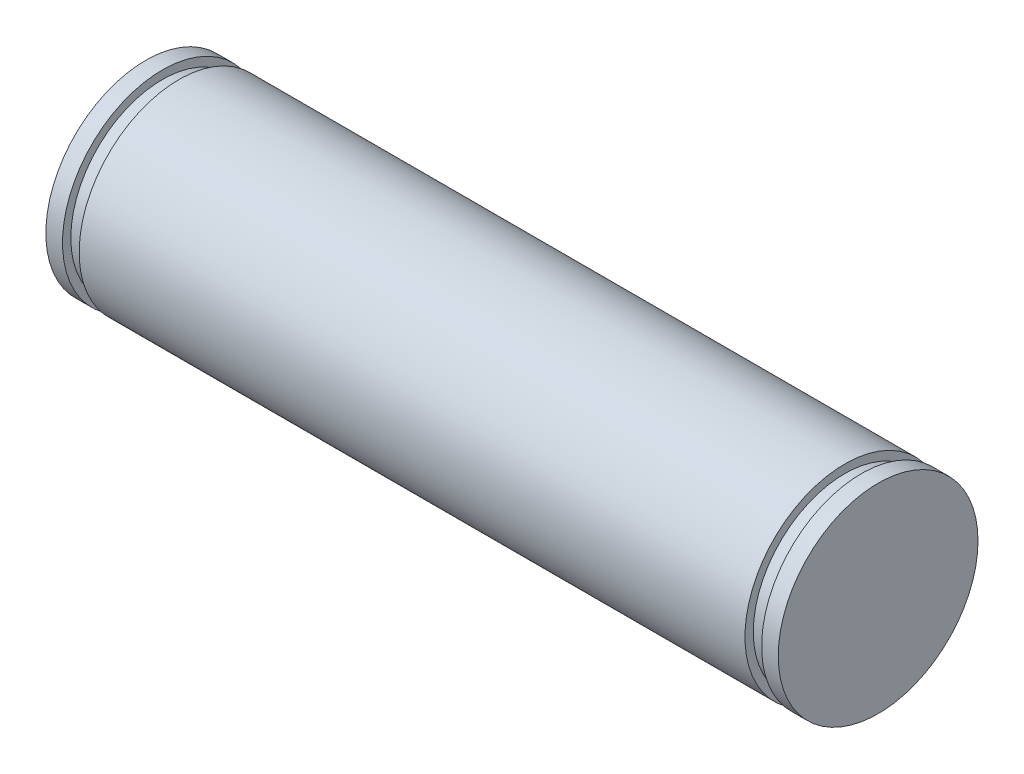
ISO-10303-21;
HEADER;
FILE_DESCRIPTION(('STEP AP214'),'2;1');
FILE_NAME('part.step','',(''),(''),'','','');
FILE_SCHEMA(('AUTOMOTIVE_DESIGN { 1 0 10303 214 1 1 1 1 }'));
ENDSEC;
DATA;
#1=APPLICATION_CONTEXT('core data for automotive mechanical design processes');
#2=APPLICATION_PROTOCOL_DEFINITION('international standard','automotive_design',2000,#1);
#3=PRODUCT_CONTEXT('',#1,'mechanical');
#4=PRODUCT('Part','Part','',(#3));
#5=PRODUCT_RELATED_PRODUCT_CATEGORY('part','',(#4));
#6=PRODUCT_DEFINITION_FORMATION('','',#4);
#7=PRODUCT_DEFINITION_CONTEXT('part definition',#1,'design');
#8=PRODUCT_DEFINITION('design','',#6,#7);
#9=PRODUCT_DEFINITION_SHAPE('','',#8);
#10=(LENGTH_UNIT() NAMED_UNIT(*) SI_UNIT(.MILLI.,.METRE.));
#11=(NAMED_UNIT(*) PLANE_ANGLE_UNIT() SI_UNIT($,.RADIAN.));
#12=(NAMED_UNIT(*) SI_UNIT($,.STERADIAN.) SOLID_ANGLE_UNIT());
#13=UNCERTAINTY_MEASURE_WITH_UNIT(LENGTH_MEASURE(1.E-05),#10,'distance_accuracy_value','');
#14=(GEOMETRIC_REPRESENTATION_CONTEXT(3) GLOBAL_UNCERTAINTY_ASSIGNED_CONTEXT((#13)) GLOBAL_UNIT_ASSIGNED_CONTEXT((#10,
#11,#12)) REPRESENTATION_CONTEXT('',''));
#15=CARTESIAN_POINT('',(0.,0.,0.));
#16=DIRECTION('',(0.,0.,1.));
#17=DIRECTION('',(1.,0.,0.));
#18=AXIS2_PLACEMENT_3D('',#15,#16,#17);
#19=CARTESIAN_POINT('',(0.,0.,0.));
#20=DIRECTION('',(1.,0.,0.));
#21=DIRECTION('',(0.,0.,-1.));
#22=AXIS2_PLACEMENT_3D('',#19,#20,#21);
#23=CYLINDRICAL_SURFACE('',#22,9.525);
#24=CARTESIAN_POINT('',(3.175,0.,0.));
#25=DIRECTION('',(1.,0.,0.));
#26=DIRECTION('',(0.,0.,-1.));
#27=AXIS2_PLACEMENT_3D('',#24,#25,#26);
#28=CIRCLE('',#27,9.525);
#29=CARTESIAN_POINT('',(3.175,0.,-9.525));
#30=VERTEX_POINT('',#29);
#31=EDGE_CURVE('E31',#30,#30,#28,.F.);
#32=ORIENTED_EDGE('',*,*,#31,.F.);
#33=EDGE_LOOP('',(#32));
#34=FACE_BOUND('',#33,.T.);
#35=CARTESIAN_POINT('',(66.675,0.,0.));
#36=DIRECTION('',(1.,0.,0.));
#37=DIRECTION('',(0.,0.,-1.));
#38=AXIS2_PLACEMENT_3D('',#35,#36,#37);
#39=CIRCLE('',#38,9.525);
#40=CARTESIAN_POINT('',(66.675,0.,-9.525));
#41=VERTEX_POINT('',#40);
#42=EDGE_CURVE('E18',#41,#41,#39,.F.);
#43=ORIENTED_EDGE('',*,*,#42,.T.);
#44=EDGE_LOOP('',(#43));
#45=FACE_BOUND('',#44,.T.);
#46=ADVANCED_FACE('F14',(#34,#45),#23,.T.);
#47=CARTESIAN_POINT('',(0.,0.,0.));
#48=DIRECTION('',(1.,0.,0.));
#49=DIRECTION('',(0.,0.,-1.));
#50=AXIS2_PLACEMENT_3D('',#47,#48,#49);
#51=CIRCLE('',#50,9.525);
#52=CARTESIAN_POINT('',(0.,0.,-9.525));
#53=VERTEX_POINT('',#52);
#54=EDGE_CURVE('E22',#53,#53,#51,.T.);
#55=ORIENTED_EDGE('',*,*,#54,.T.);
#56=EDGE_LOOP('',(#55));
#57=FACE_BOUND('',#56,.T.);
#58=CARTESIAN_POINT('',(1.5875,0.,0.));
#59=DIRECTION('',(1.,0.,0.));
#60=DIRECTION('',(0.,0.,-1.));
#61=AXIS2_PLACEMENT_3D('',#58,#59,#60);
#62=CIRCLE('',#61,9.525);
#63=CARTESIAN_POINT('',(1.5875,0.,-9.525));
#64=VERTEX_POINT('',#63);
#65=EDGE_CURVE('E27',#64,#64,#62,.F.);
#66=ORIENTED_EDGE('',*,*,#65,.T.);
#67=EDGE_LOOP('',(#66));
#68=FACE_BOUND('',#67,.T.);
#69=ADVANCED_FACE('F75',(#57,#68),#23,.T.);
#70=CARTESIAN_POINT('',(0.,0.,0.));
#71=DIRECTION('',(-1.,0.,0.));
#72=DIRECTION('',(0.,0.,1.));
#73=AXIS2_PLACEMENT_3D('',#70,#71,#72);
#74=PLANE('',#73);
#75=ORIENTED_EDGE('',*,*,#54,.F.);
#76=EDGE_LOOP('',(#75));
#77=FACE_BOUND('',#76,.T.);
#78=ADVANCED_FACE('F70',(#77),#74,.T.);
#79=CARTESIAN_POINT('',(2.38125,0.,0.));
#80=DIRECTION('',(1.,0.,0.));
#81=DIRECTION('',(0.,0.,-1.));
#82=AXIS2_PLACEMENT_3D('',#79,#80,#81);
#83=CYLINDRICAL_SURFACE('',#82,8.73125);
#84=CARTESIAN_POINT('',(3.175,0.,0.));
#85=DIRECTION('',(1.,0.,0.));
#86=DIRECTION('',(0.,0.,-1.));
#87=AXIS2_PLACEMENT_3D('',#84,#85,#86);
#88=CIRCLE('',#87,8.73125);
#89=CARTESIAN_POINT('',(3.175,0.,-8.73125));
#90=VERTEX_POINT('',#89);
#91=EDGE_CURVE('E34',#90,#90,#88,.T.);
#92=ORIENTED_EDGE('',*,*,#91,.F.);
#93=EDGE_LOOP('',(#92));
#94=FACE_BOUND('',#93,.T.);
#95=CARTESIAN_POINT('',(1.5875,0.,0.));
#96=DIRECTION('',(1.,0.,0.));
#97=DIRECTION('',(0.,0.,-1.));
#98=AXIS2_PLACEMENT_3D('',#95,#96,#97);
#99=CIRCLE('',#98,8.73125);
#100=CARTESIAN_POINT('',(1.5875,0.,-8.73125));
#101=VERTEX_POINT('',#100);
#102=EDGE_CURVE('E42',#101,#101,#99,.T.);
#103=ORIENTED_EDGE('',*,*,#102,.T.);
#104=EDGE_LOOP('',(#103));
#105=FACE_BOUND('',#104,.T.);
#106=ADVANCED_FACE('F55',(#94,#105),#83,.T.);
#107=CARTESIAN_POINT('',(1.5875,0.,0.));
#108=DIRECTION('',(1.,0.,0.));
#109=DIRECTION('',(0.,0.,-1.));
#110=AXIS2_PLACEMENT_3D('',#107,#108,#109);
#111=PLANE('',#110);
#112=ORIENTED_EDGE('',*,*,#65,.F.);
#113=EDGE_LOOP('',(#112));
#114=FACE_BOUND('',#113,.T.);
#115=ORIENTED_EDGE('',*,*,#102,.F.);
#116=EDGE_LOOP('',(#115));
#117=FACE_BOUND('',#116,.T.);
#118=ADVANCED_FACE('F57',(#114,#117),#111,.T.);
#119=CARTESIAN_POINT('',(3.175,0.,0.));
#120=DIRECTION('',(1.,0.,0.));
#121=DIRECTION('',(0.,0.,-1.));
#122=AXIS2_PLACEMENT_3D('',#119,#120,#121);
#123=PLANE('',#122);
#124=ORIENTED_EDGE('',*,*,#31,.T.);
#125=EDGE_LOOP('',(#124));
#126=FACE_BOUND('',#125,.T.);
#127=ORIENTED_EDGE('',*,*,#91,.T.);
#128=EDGE_LOOP('',(#127));
#129=FACE_BOUND('',#128,.T.);
#130=ADVANCED_FACE('F59',(#126,#129),#123,.F.);
#131=CARTESIAN_POINT('',(67.46875,0.,0.));
#132=DIRECTION('',(1.,0.,0.));
#133=DIRECTION('',(0.,0.,-1.));
#134=AXIS2_PLACEMENT_3D('',#131,#132,#133);
#135=CYLINDRICAL_SURFACE('',#134,8.73125);
#136=CARTESIAN_POINT('',(68.2625,0.,0.));
#137=DIRECTION('',(1.,0.,0.));
#138=DIRECTION('',(0.,0.,-1.));
#139=AXIS2_PLACEMENT_3D('',#136,#137,#138);
#140=CIRCLE('',#139,8.73125);
#141=CARTESIAN_POINT('',(68.2625,0.,-8.73125));
#142=VERTEX_POINT('',#141);
#143=EDGE_CURVE('E38',#142,#142,#140,.T.);
#144=ORIENTED_EDGE('',*,*,#143,.F.);
#145=EDGE_LOOP('',(#144));
#146=FACE_BOUND('',#145,.T.);
#147=CARTESIAN_POINT('',(66.675,0.,0.));
#148=DIRECTION('',(1.,0.,0.));
#149=DIRECTION('',(0.,0.,-1.));
#150=AXIS2_PLACEMENT_3D('',#147,#148,#149);
#151=CIRCLE('',#150,8.73125);
#152=CARTESIAN_POINT('',(66.675,0.,-8.73125));
#153=VERTEX_POINT('',#152);
#154=EDGE_CURVE('E44',#153,#153,#151,.T.);
#155=ORIENTED_EDGE('',*,*,#154,.T.);
#156=EDGE_LOOP('',(#155));
#157=FACE_BOUND('',#156,.T.);
#158=ADVANCED_FACE('F67',(#146,#157),#135,.T.);
#159=CARTESIAN_POINT('',(66.675,0.,0.));
#160=DIRECTION('',(1.,0.,0.));
#161=DIRECTION('',(0.,0.,-1.));
#162=AXIS2_PLACEMENT_3D('',#159,#160,#161);
#163=PLANE('',#162);
#164=ORIENTED_EDGE('',*,*,#42,.F.);
#165=EDGE_LOOP('',(#164));
#166=FACE_BOUND('',#165,.T.);
#167=ORIENTED_EDGE('',*,*,#154,.F.);
#168=EDGE_LOOP('',(#167));
#169=FACE_BOUND('',#168,.T.);
#170=ADVANCED_FACE('F94',(#166,#169),#163,.T.);
#171=CARTESIAN_POINT('',(68.2625,0.,0.));
#172=DIRECTION('',(1.,0.,0.));
#173=DIRECTION('',(0.,0.,-1.));
#174=AXIS2_PLACEMENT_3D('',#171,#172,#173);
#175=PLANE('',#174);
#176=CARTESIAN_POINT('',(68.2625,0.,0.));
#177=DIRECTION('',(1.,0.,0.));
#178=DIRECTION('',(0.,0.,-1.));
#179=AXIS2_PLACEMENT_3D('',#176,#177,#178);
#180=CIRCLE('',#179,9.525);
#181=CARTESIAN_POINT('',(68.2625,0.,-9.525));
#182=VERTEX_POINT('',#181);
#183=EDGE_CURVE('E36',#182,#182,#180,.F.);
#184=ORIENTED_EDGE('',*,*,#183,.T.);
#185=EDGE_LOOP('',(#184));
#186=FACE_BOUND('',#185,.T.);
#187=ORIENTED_EDGE('',*,*,#143,.T.);
#188=EDGE_LOOP('',(#187));
#189=FACE_BOUND('',#188,.T.);
#190=ADVANCED_FACE('F89',(#186,#189),#175,.F.);
#191=CARTESIAN_POINT('',(69.85,0.,0.));
#192=DIRECTION('',(1.,0.,0.));
#193=DIRECTION('',(0.,0.,-1.));
#194=AXIS2_PLACEMENT_3D('',#191,#192,#193);
#195=PLANE('',#194);
#196=CARTESIAN_POINT('',(69.85,0.,0.));
#197=DIRECTION('',(-1.,0.,0.));
#198=DIRECTION('',(0.,0.,1.));
#199=AXIS2_PLACEMENT_3D('',#196,#197,#198);
#200=CIRCLE('',#199,9.525);
#201=CARTESIAN_POINT('',(69.85,0.,9.525));
#202=VERTEX_POINT('',#201);
#203=EDGE_CURVE('E10',#202,#202,#200,.T.);
#204=ORIENTED_EDGE('',*,*,#203,.F.);
#205=EDGE_LOOP('',(#204));
#206=FACE_BOUND('',#205,.T.);
#207=ADVANCED_FACE('F84',(#206),#195,.T.);
#208=ORIENTED_EDGE('',*,*,#183,.F.);
#209=EDGE_LOOP('',(#208));
#210=FACE_BOUND('',#209,.T.);
#211=ORIENTED_EDGE('',*,*,#203,.T.);
#212=EDGE_LOOP('',(#211));
#213=FACE_BOUND('',#212,.T.);
#214=ADVANCED_FACE('F16',(#210,#213),#23,.T.);
#215=CLOSED_SHELL('',(#46,#69,#78,#106,#118,#130,#158,#170,#190,#207,#214));
#216=MANIFOLD_SOLID_BREP('B1',#215);
#217=ADVANCED_BREP_SHAPE_REPRESENTATION('',(#18,#216),#14);
#218=SHAPE_DEFINITION_REPRESENTATION(#9,#217);
ENDSEC;
END-ISO-10303-21;
